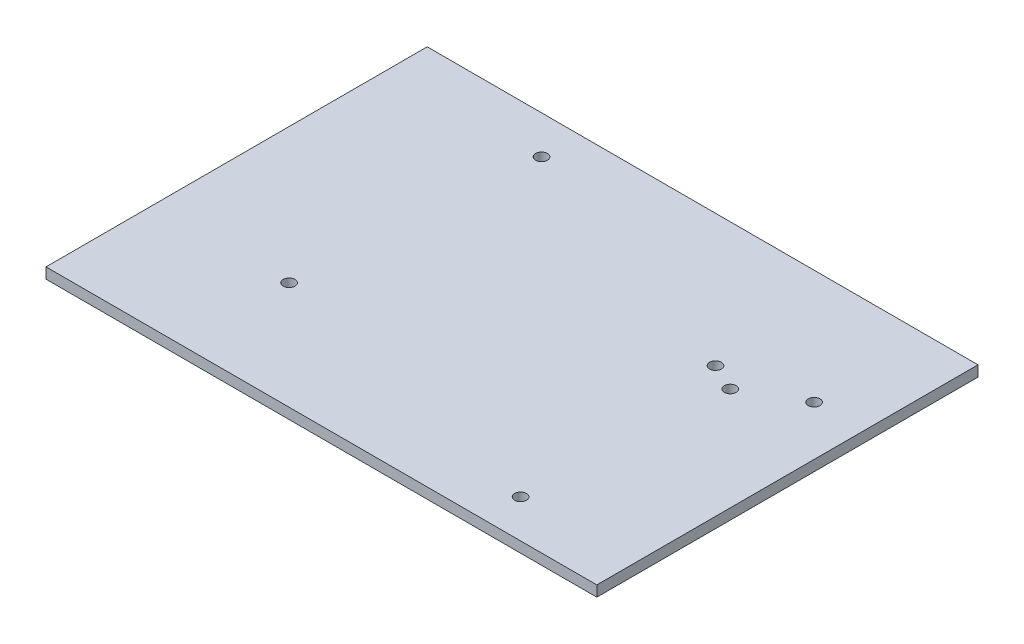
ISO-10303-21;
HEADER;
FILE_DESCRIPTION(('STEP AP214'),'2;1');
FILE_NAME('part.step','',(''),(''),'','','');
FILE_SCHEMA(('AUTOMOTIVE_DESIGN { 1 0 10303 214 1 1 1 1 }'));
ENDSEC;
DATA;
#1=APPLICATION_CONTEXT('core data for automotive mechanical design processes');
#2=APPLICATION_PROTOCOL_DEFINITION('international standard','automotive_design',2000,#1);
#3=PRODUCT_CONTEXT('',#1,'mechanical');
#4=PRODUCT('Part','Part','',(#3));
#5=PRODUCT_RELATED_PRODUCT_CATEGORY('part','',(#4));
#6=PRODUCT_DEFINITION_FORMATION('','',#4);
#7=PRODUCT_DEFINITION_CONTEXT('part definition',#1,'design');
#8=PRODUCT_DEFINITION('design','',#6,#7);
#9=PRODUCT_DEFINITION_SHAPE('','',#8);
#10=(LENGTH_UNIT() NAMED_UNIT(*) SI_UNIT(.MILLI.,.METRE.));
#11=(NAMED_UNIT(*) PLANE_ANGLE_UNIT() SI_UNIT($,.RADIAN.));
#12=(NAMED_UNIT(*) SI_UNIT($,.STERADIAN.) SOLID_ANGLE_UNIT());
#13=UNCERTAINTY_MEASURE_WITH_UNIT(LENGTH_MEASURE(1.E-05),#10,'distance_accuracy_value','');
#14=(GEOMETRIC_REPRESENTATION_CONTEXT(3) GLOBAL_UNCERTAINTY_ASSIGNED_CONTEXT((#13)) GLOBAL_UNIT_ASSIGNED_CONTEXT((#10,
#11,#12)) REPRESENTATION_CONTEXT('',''));
#15=CARTESIAN_POINT('',(0.,0.,0.));
#16=DIRECTION('',(0.,0.,1.));
#17=DIRECTION('',(1.,0.,0.));
#18=AXIS2_PLACEMENT_3D('',#15,#16,#17);
#19=CARTESIAN_POINT('',(0.,2.8,0.));
#20=DIRECTION('',(0.,-1.,0.));
#21=DIRECTION('',(0.,0.,-1.));
#22=AXIS2_PLACEMENT_3D('',#19,#20,#21);
#23=PLANE('',#22);
#24=CARTESIAN_POINT('',(37.9995377037068,2.8,-15.3809460939256));
#25=DIRECTION('',(0.,1.,0.));
#26=DIRECTION('',(0.,0.,1.));
#27=AXIS2_PLACEMENT_3D('',#24,#25,#26);
#28=CIRCLE('',#27,1.55);
#29=CARTESIAN_POINT('',(37.9995377037068,2.8,-13.8309460939256));
#30=VERTEX_POINT('',#29);
#31=EDGE_CURVE('E132',#30,#30,#28,.T.);
#32=ORIENTED_EDGE('',*,*,#31,.F.);
#33=EDGE_LOOP('',(#32));
#34=FACE_BOUND('',#33,.T.);
#35=CARTESIAN_POINT('',(45.25,2.8,-12.));
#36=DIRECTION('',(0.,1.,0.));
#37=DIRECTION('',(0.,0.,1.));
#38=AXIS2_PLACEMENT_3D('',#35,#36,#37);
#39=CIRCLE('',#38,1.55);
#40=CARTESIAN_POINT('',(45.25,2.8,-10.45));
#41=VERTEX_POINT('',#40);
#42=EDGE_CURVE('E138',#41,#41,#39,.T.);
#43=ORIENTED_EDGE('',*,*,#42,.F.);
#44=EDGE_LOOP('',(#43));
#45=FACE_BOUND('',#44,.T.);
#46=CARTESIAN_POINT('',(-36.75,2.8,21.73));
#47=DIRECTION('',(0.,1.,0.));
#48=DIRECTION('',(0.,0.,1.));
#49=AXIS2_PLACEMENT_3D('',#46,#47,#48);
#50=CIRCLE('',#49,1.55);
#51=CARTESIAN_POINT('',(-36.75,2.8,23.28));
#52=VERTEX_POINT('',#51);
#53=EDGE_CURVE('E126',#52,#52,#50,.T.);
#54=ORIENTED_EDGE('',*,*,#53,.F.);
#55=EDGE_LOOP('',(#54));
#56=FACE_BOUND('',#55,.T.);
#57=DIRECTION('',(0.,0.,-1.));
#58=VECTOR('',#57,1.);
#59=CARTESIAN_POINT('',(72.25,2.8,50.));
#60=LINE('',#59,#58);
#61=CARTESIAN_POINT('',(72.25,2.8,50.));
#62=VERTEX_POINT('',#61);
#63=CARTESIAN_POINT('',(72.25,2.8,-50.));
#64=VERTEX_POINT('',#63);
#65=EDGE_CURVE('E84',#62,#64,#60,.T.);
#66=ORIENTED_EDGE('',*,*,#65,.T.);
#67=DIRECTION('',(-1.,0.,0.));
#68=VECTOR('',#67,1.);
#69=CARTESIAN_POINT('',(-72.25,2.8,-50.));
#70=LINE('',#69,#68);
#71=CARTESIAN_POINT('',(-72.25,2.8,-50.));
#72=VERTEX_POINT('',#71);
#73=EDGE_CURVE('E79',#64,#72,#70,.T.);
#74=ORIENTED_EDGE('',*,*,#73,.T.);
#75=DIRECTION('',(0.,0.,1.));
#76=VECTOR('',#75,1.);
#77=CARTESIAN_POINT('',(-72.25,2.8,50.));
#78=LINE('',#77,#76);
#79=CARTESIAN_POINT('',(-72.25,2.8,50.));
#80=VERTEX_POINT('',#79);
#81=EDGE_CURVE('E82',#72,#80,#78,.T.);
#82=ORIENTED_EDGE('',*,*,#81,.T.);
#83=DIRECTION('',(1.,0.,0.));
#84=VECTOR('',#83,1.);
#85=CARTESIAN_POINT('',(-72.25,2.8,50.));
#86=LINE('',#85,#84);
#87=EDGE_CURVE('E49',#80,#62,#86,.T.);
#88=ORIENTED_EDGE('',*,*,#87,.T.);
#89=EDGE_LOOP('',(#66,#74,#82,#88));
#90=FACE_BOUND('',#89,.T.);
#91=CARTESIAN_POINT('',(-32.25,2.8,-40.));
#92=DIRECTION('',(0.,1.,0.));
#93=DIRECTION('',(0.,0.,1.));
#94=AXIS2_PLACEMENT_3D('',#91,#92,#93);
#95=CIRCLE('',#94,1.55);
#96=CARTESIAN_POINT('',(-32.25,2.8,-38.45));
#97=VERTEX_POINT('',#96);
#98=EDGE_CURVE('E99',#97,#97,#95,.T.);
#99=ORIENTED_EDGE('',*,*,#98,.F.);
#100=EDGE_LOOP('',(#99));
#101=FACE_BOUND('',#100,.T.);
#102=CARTESIAN_POINT('',(59.25,2.8,-20.));
#103=DIRECTION('',(0.,1.,0.));
#104=DIRECTION('',(0.,0.,1.));
#105=AXIS2_PLACEMENT_3D('',#102,#103,#104);
#106=CIRCLE('',#105,1.54999999999999);
#107=CARTESIAN_POINT('',(59.25,2.8,-18.45));
#108=VERTEX_POINT('',#107);
#109=EDGE_CURVE('E114',#108,#108,#106,.T.);
#110=ORIENTED_EDGE('',*,*,#109,.F.);
#111=EDGE_LOOP('',(#110));
#112=FACE_BOUND('',#111,.T.);
#113=CARTESIAN_POINT('',(42.25,2.8,40.));
#114=DIRECTION('',(0.,1.,0.));
#115=DIRECTION('',(0.,0.,1.));
#116=AXIS2_PLACEMENT_3D('',#113,#114,#115);
#117=CIRCLE('',#116,1.55);
#118=CARTESIAN_POINT('',(42.25,2.8,41.55));
#119=VERTEX_POINT('',#118);
#120=EDGE_CURVE('E120',#119,#119,#117,.T.);
#121=ORIENTED_EDGE('',*,*,#120,.F.);
#122=EDGE_LOOP('',(#121));
#123=FACE_BOUND('',#122,.T.);
#124=ADVANCED_FACE('F32',(#34,#45,#56,#90,#101,#112,#123),#23,.F.);
#125=CARTESIAN_POINT('',(0.,0.,0.));
#126=DIRECTION('',(0.,-1.,0.));
#127=DIRECTION('',(0.,0.,-1.));
#128=AXIS2_PLACEMENT_3D('',#125,#126,#127);
#129=PLANE('',#128);
#130=CARTESIAN_POINT('',(37.9995377037068,0.,-15.3809460939256));
#131=DIRECTION('',(0.,-1.,0.));
#132=DIRECTION('',(0.,0.,-1.));
#133=AXIS2_PLACEMENT_3D('',#130,#131,#132);
#134=CIRCLE('',#133,1.55);
#135=CARTESIAN_POINT('',(37.9995377037068,0.,-16.9309460939256));
#136=VERTEX_POINT('',#135);
#137=EDGE_CURVE('E141',#136,#136,#134,.F.);
#138=ORIENTED_EDGE('',*,*,#137,.T.);
#139=EDGE_LOOP('',(#138));
#140=FACE_BOUND('',#139,.T.);
#141=CARTESIAN_POINT('',(45.25,0.,-12.));
#142=DIRECTION('',(0.,-1.,0.));
#143=DIRECTION('',(0.,0.,-1.));
#144=AXIS2_PLACEMENT_3D('',#141,#142,#143);
#145=CIRCLE('',#144,1.55);
#146=CARTESIAN_POINT('',(45.25,0.,-13.55));
#147=VERTEX_POINT('',#146);
#148=EDGE_CURVE('E135',#147,#147,#145,.F.);
#149=ORIENTED_EDGE('',*,*,#148,.T.);
#150=EDGE_LOOP('',(#149));
#151=FACE_BOUND('',#150,.T.);
#152=CARTESIAN_POINT('',(-36.75,0.,21.73));
#153=DIRECTION('',(0.,-1.,0.));
#154=DIRECTION('',(0.,0.,-1.));
#155=AXIS2_PLACEMENT_3D('',#152,#153,#154);
#156=CIRCLE('',#155,1.55);
#157=CARTESIAN_POINT('',(-36.75,0.,20.18));
#158=VERTEX_POINT('',#157);
#159=EDGE_CURVE('E129',#158,#158,#156,.F.);
#160=ORIENTED_EDGE('',*,*,#159,.T.);
#161=EDGE_LOOP('',(#160));
#162=FACE_BOUND('',#161,.T.);
#163=CARTESIAN_POINT('',(59.25,0.,-20.));
#164=DIRECTION('',(0.,1.,0.));
#165=DIRECTION('',(0.,0.,1.));
#166=AXIS2_PLACEMENT_3D('',#163,#164,#165);
#167=CIRCLE('',#166,1.54999999999999);
#168=CARTESIAN_POINT('',(59.25,0.,-18.45));
#169=VERTEX_POINT('',#168);
#170=EDGE_CURVE('E117',#169,#169,#167,.T.);
#171=ORIENTED_EDGE('',*,*,#170,.T.);
#172=EDGE_LOOP('',(#171));
#173=FACE_BOUND('',#172,.T.);
#174=DIRECTION('',(0.,0.,-1.));
#175=VECTOR('',#174,1.);
#176=CARTESIAN_POINT('',(72.25,0.,50.));
#177=LINE('',#176,#175);
#178=CARTESIAN_POINT('',(72.25,0.,50.));
#179=VERTEX_POINT('',#178);
#180=CARTESIAN_POINT('',(72.25,0.,-50.));
#181=VERTEX_POINT('',#180);
#182=EDGE_CURVE('E96',#179,#181,#177,.T.);
#183=ORIENTED_EDGE('',*,*,#182,.F.);
#184=DIRECTION('',(1.,0.,0.));
#185=VECTOR('',#184,1.);
#186=CARTESIAN_POINT('',(-72.25,0.,50.));
#187=LINE('',#186,#185);
#188=CARTESIAN_POINT('',(-72.25,0.,50.));
#189=VERTEX_POINT('',#188);
#190=EDGE_CURVE('E72',#189,#179,#187,.T.);
#191=ORIENTED_EDGE('',*,*,#190,.F.);
#192=DIRECTION('',(0.,0.,1.));
#193=VECTOR('',#192,1.);
#194=CARTESIAN_POINT('',(-72.25,0.,50.));
#195=LINE('',#194,#193);
#196=CARTESIAN_POINT('',(-72.25,0.,-50.));
#197=VERTEX_POINT('',#196);
#198=EDGE_CURVE('E66',#197,#189,#195,.T.);
#199=ORIENTED_EDGE('',*,*,#198,.F.);
#200=DIRECTION('',(-1.,0.,0.));
#201=VECTOR('',#200,1.);
#202=CARTESIAN_POINT('',(-72.25,0.,-50.));
#203=LINE('',#202,#201);
#204=EDGE_CURVE('E88',#181,#197,#203,.T.);
#205=ORIENTED_EDGE('',*,*,#204,.F.);
#206=EDGE_LOOP('',(#183,#191,#199,#205));
#207=FACE_BOUND('',#206,.T.);
#208=CARTESIAN_POINT('',(-32.25,0.,-40.));
#209=DIRECTION('',(0.,1.,0.));
#210=DIRECTION('',(0.,0.,1.));
#211=AXIS2_PLACEMENT_3D('',#208,#209,#210);
#212=CIRCLE('',#211,1.55);
#213=CARTESIAN_POINT('',(-32.25,0.,-38.45));
#214=VERTEX_POINT('',#213);
#215=EDGE_CURVE('E111',#214,#214,#212,.T.);
#216=ORIENTED_EDGE('',*,*,#215,.T.);
#217=EDGE_LOOP('',(#216));
#218=FACE_BOUND('',#217,.T.);
#219=CARTESIAN_POINT('',(42.25,0.,40.));
#220=DIRECTION('',(0.,1.,0.));
#221=DIRECTION('',(0.,0.,1.));
#222=AXIS2_PLACEMENT_3D('',#219,#220,#221);
#223=CIRCLE('',#222,1.55);
#224=CARTESIAN_POINT('',(42.25,0.,41.55));
#225=VERTEX_POINT('',#224);
#226=EDGE_CURVE('E123',#225,#225,#223,.T.);
#227=ORIENTED_EDGE('',*,*,#226,.T.);
#228=EDGE_LOOP('',(#227));
#229=FACE_BOUND('',#228,.T.);
#230=ADVANCED_FACE('F107',(#140,#151,#162,#173,#207,#218,#229),#129,.T.);
#231=CARTESIAN_POINT('',(72.25,2.8,50.));
#232=DIRECTION('',(-1.,0.,0.));
#233=DIRECTION('',(0.,0.,1.));
#234=AXIS2_PLACEMENT_3D('',#231,#232,#233);
#235=PLANE('',#234);
#236=ORIENTED_EDGE('',*,*,#182,.T.);
#237=DIRECTION('',(0.,-1.,0.));
#238=VECTOR('',#237,1.);
#239=CARTESIAN_POINT('',(72.25,2.8,-50.));
#240=LINE('',#239,#238);
#241=EDGE_CURVE('E11',#64,#181,#240,.T.);
#242=ORIENTED_EDGE('',*,*,#241,.F.);
#243=ORIENTED_EDGE('',*,*,#65,.F.);
#244=DIRECTION('',(0.,-1.,0.));
#245=VECTOR('',#244,1.);
#246=CARTESIAN_POINT('',(72.25,2.8,50.));
#247=LINE('',#246,#245);
#248=EDGE_CURVE('E92',#62,#179,#247,.T.);
#249=ORIENTED_EDGE('',*,*,#248,.T.);
#250=EDGE_LOOP('',(#236,#242,#243,#249));
#251=FACE_BOUND('',#250,.T.);
#252=ADVANCED_FACE('F34',(#251),#235,.F.);
#253=CARTESIAN_POINT('',(-72.25,2.8,-50.));
#254=DIRECTION('',(0.,0.,1.));
#255=DIRECTION('',(1.,0.,0.));
#256=AXIS2_PLACEMENT_3D('',#253,#254,#255);
#257=PLANE('',#256);
#258=ORIENTED_EDGE('',*,*,#204,.T.);
#259=DIRECTION('',(0.,-1.,0.));
#260=VECTOR('',#259,1.);
#261=CARTESIAN_POINT('',(-72.25,2.8,-50.));
#262=LINE('',#261,#260);
#263=EDGE_CURVE('E41',#72,#197,#262,.T.);
#264=ORIENTED_EDGE('',*,*,#263,.F.);
#265=ORIENTED_EDGE('',*,*,#73,.F.);
#266=ORIENTED_EDGE('',*,*,#241,.T.);
#267=EDGE_LOOP('',(#258,#264,#265,#266));
#268=FACE_BOUND('',#267,.T.);
#269=ADVANCED_FACE('F87',(#268),#257,.F.);
#270=CARTESIAN_POINT('',(-72.25,2.8,50.));
#271=DIRECTION('',(1.,0.,0.));
#272=DIRECTION('',(0.,0.,-1.));
#273=AXIS2_PLACEMENT_3D('',#270,#271,#272);
#274=PLANE('',#273);
#275=ORIENTED_EDGE('',*,*,#198,.T.);
#276=DIRECTION('',(0.,-1.,0.));
#277=VECTOR('',#276,1.);
#278=CARTESIAN_POINT('',(-72.25,2.8,50.));
#279=LINE('',#278,#277);
#280=EDGE_CURVE('E89',#80,#189,#279,.T.);
#281=ORIENTED_EDGE('',*,*,#280,.F.);
#282=ORIENTED_EDGE('',*,*,#81,.F.);
#283=ORIENTED_EDGE('',*,*,#263,.T.);
#284=EDGE_LOOP('',(#275,#281,#282,#283));
#285=FACE_BOUND('',#284,.T.);
#286=ADVANCED_FACE('F90',(#285),#274,.F.);
#287=CARTESIAN_POINT('',(-72.25,2.8,50.));
#288=DIRECTION('',(0.,0.,-1.));
#289=DIRECTION('',(-1.,0.,0.));
#290=AXIS2_PLACEMENT_3D('',#287,#288,#289);
#291=PLANE('',#290);
#292=ORIENTED_EDGE('',*,*,#190,.T.);
#293=ORIENTED_EDGE('',*,*,#248,.F.);
#294=ORIENTED_EDGE('',*,*,#87,.F.);
#295=ORIENTED_EDGE('',*,*,#280,.T.);
#296=EDGE_LOOP('',(#292,#293,#294,#295));
#297=FACE_BOUND('',#296,.T.);
#298=ADVANCED_FACE('F104',(#297),#291,.F.);
#299=CARTESIAN_POINT('',(-32.25,2.8,-40.));
#300=DIRECTION('',(0.,-1.,0.));
#301=DIRECTION('',(0.,0.,-1.));
#302=AXIS2_PLACEMENT_3D('',#299,#300,#301);
#303=CYLINDRICAL_SURFACE('',#302,1.55);
#304=ORIENTED_EDGE('',*,*,#98,.T.);
#305=EDGE_LOOP('',(#304));
#306=FACE_BOUND('',#305,.T.);
#307=ORIENTED_EDGE('',*,*,#215,.F.);
#308=EDGE_LOOP('',(#307));
#309=FACE_BOUND('',#308,.T.);
#310=ADVANCED_FACE('F176',(#306,#309),#303,.F.);
#311=CARTESIAN_POINT('',(59.25,2.8,-20.));
#312=DIRECTION('',(0.,-1.,0.));
#313=DIRECTION('',(0.,0.,-1.));
#314=AXIS2_PLACEMENT_3D('',#311,#312,#313);
#315=CYLINDRICAL_SURFACE('',#314,1.54999999999999);
#316=ORIENTED_EDGE('',*,*,#109,.T.);
#317=EDGE_LOOP('',(#316));
#318=FACE_BOUND('',#317,.T.);
#319=ORIENTED_EDGE('',*,*,#170,.F.);
#320=EDGE_LOOP('',(#319));
#321=FACE_BOUND('',#320,.T.);
#322=ADVANCED_FACE('F168',(#318,#321),#315,.F.);
#323=CARTESIAN_POINT('',(42.25,2.8,40.));
#324=DIRECTION('',(0.,-1.,0.));
#325=DIRECTION('',(0.,0.,-1.));
#326=AXIS2_PLACEMENT_3D('',#323,#324,#325);
#327=CYLINDRICAL_SURFACE('',#326,1.55);
#328=ORIENTED_EDGE('',*,*,#120,.T.);
#329=EDGE_LOOP('',(#328));
#330=FACE_BOUND('',#329,.T.);
#331=ORIENTED_EDGE('',*,*,#226,.F.);
#332=EDGE_LOOP('',(#331));
#333=FACE_BOUND('',#332,.T.);
#334=ADVANCED_FACE('F159',(#330,#333),#327,.F.);
#335=CARTESIAN_POINT('',(-36.75,-0.00100000000000013,21.73));
#336=DIRECTION('',(0.,1.,0.));
#337=DIRECTION('',(0.,0.,1.));
#338=AXIS2_PLACEMENT_3D('',#335,#336,#337);
#339=CYLINDRICAL_SURFACE('',#338,1.55);
#340=ORIENTED_EDGE('',*,*,#159,.F.);
#341=EDGE_LOOP('',(#340));
#342=FACE_BOUND('',#341,.T.);
#343=ORIENTED_EDGE('',*,*,#53,.T.);
#344=EDGE_LOOP('',(#343));
#345=FACE_BOUND('',#344,.T.);
#346=ADVANCED_FACE('F156',(#342,#345),#339,.F.);
#347=CARTESIAN_POINT('',(45.25,-0.00100000000000013,-12.));
#348=DIRECTION('',(0.,1.,0.));
#349=DIRECTION('',(0.,0.,1.));
#350=AXIS2_PLACEMENT_3D('',#347,#348,#349);
#351=CYLINDRICAL_SURFACE('',#350,1.55);
#352=ORIENTED_EDGE('',*,*,#148,.F.);
#353=EDGE_LOOP('',(#352));
#354=FACE_BOUND('',#353,.T.);
#355=ORIENTED_EDGE('',*,*,#42,.T.);
#356=EDGE_LOOP('',(#355));
#357=FACE_BOUND('',#356,.T.);
#358=ADVANCED_FACE('F158',(#354,#357),#351,.F.);
#359=CARTESIAN_POINT('',(37.9995377037068,-0.00100000000000013,-15.3809460939256));
#360=DIRECTION('',(0.,1.,0.));
#361=DIRECTION('',(0.,0.,1.));
#362=AXIS2_PLACEMENT_3D('',#359,#360,#361);
#363=CYLINDRICAL_SURFACE('',#362,1.55);
#364=ORIENTED_EDGE('',*,*,#137,.F.);
#365=EDGE_LOOP('',(#364));
#366=FACE_BOUND('',#365,.T.);
#367=ORIENTED_EDGE('',*,*,#31,.T.);
#368=EDGE_LOOP('',(#367));
#369=FACE_BOUND('',#368,.T.);
#370=ADVANCED_FACE('F147',(#366,#369),#363,.F.);
#371=CLOSED_SHELL('',(#124,#230,#252,#269,#286,#298,#310,#322,#334,#346,#358,#370));
#372=MANIFOLD_SOLID_BREP('B2',#371);
#373=ADVANCED_BREP_SHAPE_REPRESENTATION('',(#18,#372),#14);
#374=SHAPE_DEFINITION_REPRESENTATION(#9,#373);
ENDSEC;
END-ISO-10303-21;
